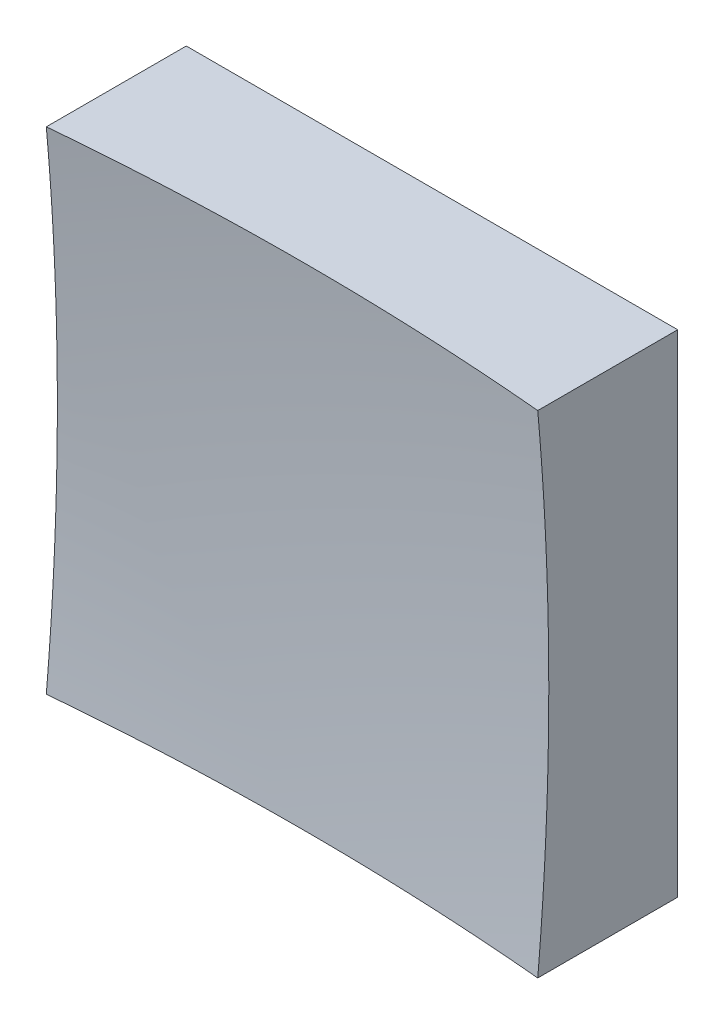
ISO-10303-21;
HEADER;
FILE_DESCRIPTION(('STEP AP214'),'2;1');
FILE_NAME('part.step','',(''),(''),'','','');
FILE_SCHEMA(('AUTOMOTIVE_DESIGN { 1 0 10303 214 1 1 1 1 }'));
ENDSEC;
DATA;
#1=APPLICATION_CONTEXT('core data for automotive mechanical design processes');
#2=APPLICATION_PROTOCOL_DEFINITION('international standard','automotive_design',2000,#1);
#3=PRODUCT_CONTEXT('',#1,'mechanical');
#4=PRODUCT('Part','Part','',(#3));
#5=PRODUCT_RELATED_PRODUCT_CATEGORY('part','',(#4));
#6=PRODUCT_DEFINITION_FORMATION('','',#4);
#7=PRODUCT_DEFINITION_CONTEXT('part definition',#1,'design');
#8=PRODUCT_DEFINITION('design','',#6,#7);
#9=PRODUCT_DEFINITION_SHAPE('','',#8);
#10=(LENGTH_UNIT() NAMED_UNIT(*) SI_UNIT(.MILLI.,.METRE.));
#11=(NAMED_UNIT(*) PLANE_ANGLE_UNIT() SI_UNIT($,.RADIAN.));
#12=(NAMED_UNIT(*) SI_UNIT($,.STERADIAN.) SOLID_ANGLE_UNIT());
#13=UNCERTAINTY_MEASURE_WITH_UNIT(LENGTH_MEASURE(1.E-05),#10,'distance_accuracy_value','');
#14=(GEOMETRIC_REPRESENTATION_CONTEXT(3) GLOBAL_UNCERTAINTY_ASSIGNED_CONTEXT((#13)) GLOBAL_UNIT_ASSIGNED_CONTEXT((#10,
#11,#12)) REPRESENTATION_CONTEXT('',''));
#15=CARTESIAN_POINT('',(0.,0.,0.));
#16=DIRECTION('',(0.,0.,1.));
#17=DIRECTION('',(1.,0.,0.));
#18=AXIS2_PLACEMENT_3D('',#15,#16,#17);
#19=CARTESIAN_POINT('',(-6.25,6.25,10.));
#20=DIRECTION('',(0.,1.,0.));
#21=DIRECTION('',(0.,0.,1.));
#22=AXIS2_PLACEMENT_3D('',#19,#20,#21);
#23=PLANE('',#22);
#24=CARTESIAN_POINT('',(0.,6.25,73.));
#25=DIRECTION('',(0.,1.,0.));
#26=DIRECTION('',(0.,0.,1.));
#27=AXIS2_PLACEMENT_3D('',#24,#25,#26);
#28=CIRCLE('',#27,69.7204238369217);
#29=CARTESIAN_POINT('',(6.25,6.25,3.56027793834426));
#30=VERTEX_POINT('',#29);
#31=CARTESIAN_POINT('',(-6.25,6.25,3.56027793834426));
#32=VERTEX_POINT('',#31);
#33=EDGE_CURVE('E79',#30,#32,#28,.T.);
#34=ORIENTED_EDGE('',*,*,#33,.F.);
#35=DIRECTION('',(0.,0.,-1.));
#36=VECTOR('',#35,1.);
#37=CARTESIAN_POINT('',(6.25,6.25,10.));
#38=LINE('',#37,#36);
#39=CARTESIAN_POINT('',(6.25,6.25,0.));
#40=VERTEX_POINT('',#39);
#41=EDGE_CURVE('E85',#30,#40,#38,.T.);
#42=ORIENTED_EDGE('',*,*,#41,.T.);
#43=DIRECTION('',(1.,0.,0.));
#44=VECTOR('',#43,1.);
#45=CARTESIAN_POINT('',(-6.25,6.25,0.));
#46=LINE('',#45,#44);
#47=CARTESIAN_POINT('',(-6.25,6.25,0.));
#48=VERTEX_POINT('',#47);
#49=EDGE_CURVE('E88',#48,#40,#46,.T.);
#50=ORIENTED_EDGE('',*,*,#49,.F.);
#51=DIRECTION('',(0.,0.,-1.));
#52=VECTOR('',#51,1.);
#53=CARTESIAN_POINT('',(-6.25,6.25,10.));
#54=LINE('',#53,#52);
#55=EDGE_CURVE('E47',#32,#48,#54,.T.);
#56=ORIENTED_EDGE('',*,*,#55,.F.);
#57=EDGE_LOOP('',(#34,#42,#50,#56));
#58=FACE_BOUND('',#57,.T.);
#59=ADVANCED_FACE('F39',(#58),#23,.T.);
#60=CARTESIAN_POINT('',(-6.25,6.25,10.));
#61=DIRECTION('',(1.,0.,0.));
#62=DIRECTION('',(0.,0.,-1.));
#63=AXIS2_PLACEMENT_3D('',#60,#61,#62);
#64=PLANE('',#63);
#65=DIRECTION('',(0.,0.,-1.));
#66=VECTOR('',#65,1.);
#67=CARTESIAN_POINT('',(-6.25,-6.25,10.));
#68=LINE('',#67,#66);
#69=CARTESIAN_POINT('',(-6.25,-6.25,3.56027793834426));
#70=VERTEX_POINT('',#69);
#71=CARTESIAN_POINT('',(-6.25,-6.25,0.));
#72=VERTEX_POINT('',#71);
#73=EDGE_CURVE('E100',#70,#72,#68,.T.);
#74=ORIENTED_EDGE('',*,*,#73,.F.);
#75=CARTESIAN_POINT('',(-6.25,0.,73.));
#76=DIRECTION('',(1.,0.,0.));
#77=DIRECTION('',(0.,0.,-1.));
#78=AXIS2_PLACEMENT_3D('',#75,#76,#77);
#79=CIRCLE('',#78,69.7204238369217);
#80=EDGE_CURVE('E89',#70,#32,#79,.T.);
#81=ORIENTED_EDGE('',*,*,#80,.T.);
#82=ORIENTED_EDGE('',*,*,#55,.T.);
#83=DIRECTION('',(0.,-1.,0.));
#84=VECTOR('',#83,1.);
#85=CARTESIAN_POINT('',(-6.25,6.25,0.));
#86=LINE('',#85,#84);
#87=EDGE_CURVE('E97',#48,#72,#86,.T.);
#88=ORIENTED_EDGE('',*,*,#87,.T.);
#89=EDGE_LOOP('',(#74,#81,#82,#88));
#90=FACE_BOUND('',#89,.T.);
#91=ADVANCED_FACE('F122',(#90),#64,.F.);
#92=CARTESIAN_POINT('',(-6.25,-6.25,10.));
#93=DIRECTION('',(0.,1.,0.));
#94=DIRECTION('',(0.,0.,1.));
#95=AXIS2_PLACEMENT_3D('',#92,#93,#94);
#96=PLANE('',#95);
#97=DIRECTION('',(0.,0.,-1.));
#98=VECTOR('',#97,1.);
#99=CARTESIAN_POINT('',(6.25,-6.25,10.));
#100=LINE('',#99,#98);
#101=CARTESIAN_POINT('',(6.25,-6.25,3.56027793834426));
#102=VERTEX_POINT('',#101);
#103=CARTESIAN_POINT('',(6.25,-6.25,0.));
#104=VERTEX_POINT('',#103);
#105=EDGE_CURVE('E96',#102,#104,#100,.T.);
#106=ORIENTED_EDGE('',*,*,#105,.F.);
#107=CARTESIAN_POINT('',(0.,-6.25,73.));
#108=DIRECTION('',(0.,1.,0.));
#109=DIRECTION('',(0.,0.,1.));
#110=AXIS2_PLACEMENT_3D('',#107,#108,#109);
#111=CIRCLE('',#110,69.7204238369217);
#112=EDGE_CURVE('E53',#102,#70,#111,.T.);
#113=ORIENTED_EDGE('',*,*,#112,.T.);
#114=ORIENTED_EDGE('',*,*,#73,.T.);
#115=DIRECTION('',(1.,0.,0.));
#116=VECTOR('',#115,1.);
#117=CARTESIAN_POINT('',(-6.25,-6.25,0.));
#118=LINE('',#117,#116);
#119=EDGE_CURVE('E102',#72,#104,#118,.T.);
#120=ORIENTED_EDGE('',*,*,#119,.T.);
#121=EDGE_LOOP('',(#106,#113,#114,#120));
#122=FACE_BOUND('',#121,.T.);
#123=ADVANCED_FACE('F121',(#122),#96,.F.);
#124=CARTESIAN_POINT('',(6.25,6.25,10.));
#125=DIRECTION('',(1.,0.,0.));
#126=DIRECTION('',(0.,0.,-1.));
#127=AXIS2_PLACEMENT_3D('',#124,#125,#126);
#128=PLANE('',#127);
#129=CARTESIAN_POINT('',(6.25,0.,73.));
#130=DIRECTION('',(1.,0.,0.));
#131=DIRECTION('',(0.,0.,-1.));
#132=AXIS2_PLACEMENT_3D('',#129,#130,#131);
#133=CIRCLE('',#132,69.7204238369217);
#134=EDGE_CURVE('E11',#102,#30,#133,.T.);
#135=ORIENTED_EDGE('',*,*,#134,.F.);
#136=ORIENTED_EDGE('',*,*,#105,.T.);
#137=DIRECTION('',(0.,-1.,0.));
#138=VECTOR('',#137,1.);
#139=CARTESIAN_POINT('',(6.25,6.25,0.));
#140=LINE('',#139,#138);
#141=EDGE_CURVE('E93',#40,#104,#140,.T.);
#142=ORIENTED_EDGE('',*,*,#141,.F.);
#143=ORIENTED_EDGE('',*,*,#41,.F.);
#144=EDGE_LOOP('',(#135,#136,#142,#143));
#145=FACE_BOUND('',#144,.T.);
#146=ADVANCED_FACE('F91',(#145),#128,.T.);
#147=CARTESIAN_POINT('',(0.,0.,0.));
#148=DIRECTION('',(0.,0.,-1.));
#149=DIRECTION('',(-1.,0.,0.));
#150=AXIS2_PLACEMENT_3D('',#147,#148,#149);
#151=PLANE('',#150);
#152=ORIENTED_EDGE('',*,*,#49,.T.);
#153=ORIENTED_EDGE('',*,*,#141,.T.);
#154=ORIENTED_EDGE('',*,*,#119,.F.);
#155=ORIENTED_EDGE('',*,*,#87,.F.);
#156=EDGE_LOOP('',(#152,#153,#154,#155));
#157=FACE_BOUND('',#156,.T.);
#158=ADVANCED_FACE('F125',(#157),#151,.T.);
#159=CARTESIAN_POINT('',(0.,0.,73.));
#160=DIRECTION('',(0.,0.,1.));
#161=DIRECTION('',(1.,0.,0.));
#162=AXIS2_PLACEMENT_3D('',#159,#160,#161);
#163=SPHERICAL_SURFACE('',#162,70.);
#164=ORIENTED_EDGE('',*,*,#33,.T.);
#165=ORIENTED_EDGE('',*,*,#80,.F.);
#166=ORIENTED_EDGE('',*,*,#112,.F.);
#167=ORIENTED_EDGE('',*,*,#134,.T.);
#168=EDGE_LOOP('',(#164,#165,#166,#167));
#169=FACE_BOUND('',#168,.T.);
#170=ADVANCED_FACE('F78',(#169),#163,.F.);
#171=CLOSED_SHELL('',(#59,#91,#123,#146,#158,#170));
#172=MANIFOLD_SOLID_BREP('B2',#171);
#173=ADVANCED_BREP_SHAPE_REPRESENTATION('',(#18,#172),#14);
#174=SHAPE_DEFINITION_REPRESENTATION(#9,#173);
ENDSEC;
END-ISO-10303-21;
